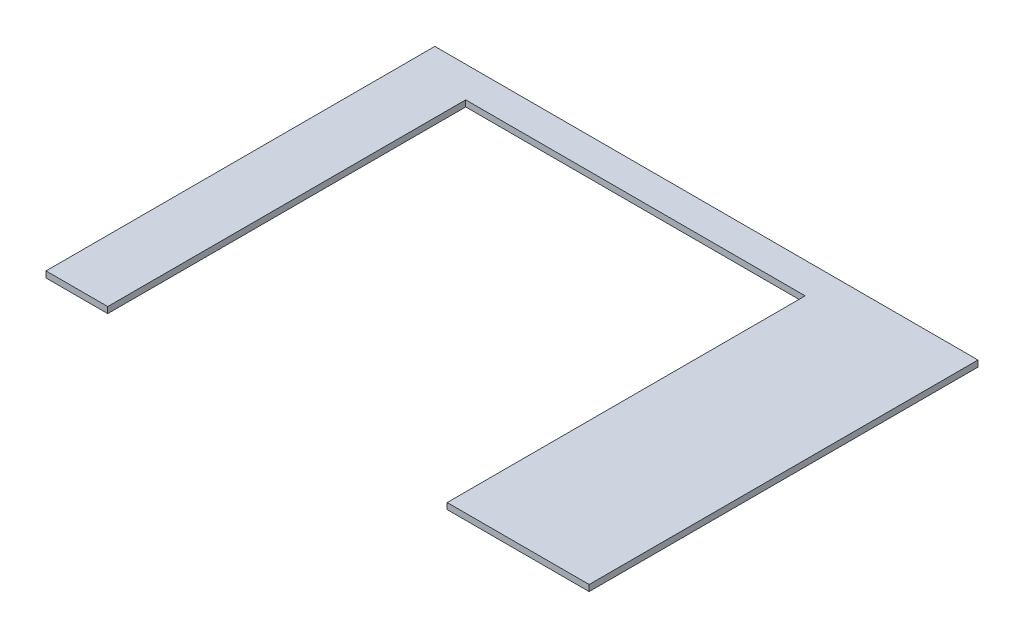
ISO-10303-21;
HEADER;
FILE_DESCRIPTION(('STEP AP214'),'2;1');
FILE_NAME('part.step','',(''),(''),'','','');
FILE_SCHEMA(('AUTOMOTIVE_DESIGN { 1 0 10303 214 1 1 1 1 }'));
ENDSEC;
DATA;
#1=APPLICATION_CONTEXT('core data for automotive mechanical design processes');
#2=APPLICATION_PROTOCOL_DEFINITION('international standard','automotive_design',2000,#1);
#3=PRODUCT_CONTEXT('',#1,'mechanical');
#4=PRODUCT('Part','Part','',(#3));
#5=PRODUCT_RELATED_PRODUCT_CATEGORY('part','',(#4));
#6=PRODUCT_DEFINITION_FORMATION('','',#4);
#7=PRODUCT_DEFINITION_CONTEXT('part definition',#1,'design');
#8=PRODUCT_DEFINITION('design','',#6,#7);
#9=PRODUCT_DEFINITION_SHAPE('','',#8);
#10=(LENGTH_UNIT() NAMED_UNIT(*) SI_UNIT(.MILLI.,.METRE.));
#11=(NAMED_UNIT(*) PLANE_ANGLE_UNIT() SI_UNIT($,.RADIAN.));
#12=(NAMED_UNIT(*) SI_UNIT($,.STERADIAN.) SOLID_ANGLE_UNIT());
#13=UNCERTAINTY_MEASURE_WITH_UNIT(LENGTH_MEASURE(1.E-05),#10,'distance_accuracy_value','');
#14=(GEOMETRIC_REPRESENTATION_CONTEXT(3) GLOBAL_UNCERTAINTY_ASSIGNED_CONTEXT((#13)) GLOBAL_UNIT_ASSIGNED_CONTEXT((#10,
#11,#12)) REPRESENTATION_CONTEXT('',''));
#15=CARTESIAN_POINT('',(0.,0.,0.));
#16=DIRECTION('',(0.,0.,1.));
#17=DIRECTION('',(1.,0.,0.));
#18=AXIS2_PLACEMENT_3D('',#15,#16,#17);
#19=CARTESIAN_POINT('',(0.,10.,0.));
#20=DIRECTION('',(1.,0.,0.));
#21=DIRECTION('',(0.,0.,-1.));
#22=AXIS2_PLACEMENT_3D('',#19,#20,#21);
#23=PLANE('',#22);
#24=DIRECTION('',(0.,0.,1.));
#25=VECTOR('',#24,1.);
#26=CARTESIAN_POINT('',(0.,0.,0.));
#27=LINE('',#26,#25);
#28=CARTESIAN_POINT('',(0.,0.,-630.));
#29=VERTEX_POINT('',#28);
#30=CARTESIAN_POINT('',(0.,0.,0.));
#31=VERTEX_POINT('',#30);
#32=EDGE_CURVE('E131',#29,#31,#27,.T.);
#33=ORIENTED_EDGE('',*,*,#32,.T.);
#34=DIRECTION('',(0.,-1.,0.));
#35=VECTOR('',#34,1.);
#36=CARTESIAN_POINT('',(0.,10.,0.));
#37=LINE('',#36,#35);
#38=CARTESIAN_POINT('',(0.,10.,0.));
#39=VERTEX_POINT('',#38);
#40=EDGE_CURVE('E11',#39,#31,#37,.T.);
#41=ORIENTED_EDGE('',*,*,#40,.F.);
#42=DIRECTION('',(0.,0.,1.));
#43=VECTOR('',#42,1.);
#44=CARTESIAN_POINT('',(0.,10.,0.));
#45=LINE('',#44,#43);
#46=CARTESIAN_POINT('',(0.,10.,-630.));
#47=VERTEX_POINT('',#46);
#48=EDGE_CURVE('E145',#47,#39,#45,.T.);
#49=ORIENTED_EDGE('',*,*,#48,.F.);
#50=DIRECTION('',(0.,-1.,0.));
#51=VECTOR('',#50,1.);
#52=CARTESIAN_POINT('',(0.,10.,-630.));
#53=LINE('',#52,#51);
#54=EDGE_CURVE('E127',#47,#29,#53,.T.);
#55=ORIENTED_EDGE('',*,*,#54,.T.);
#56=EDGE_LOOP('',(#33,#41,#49,#55));
#57=FACE_BOUND('',#56,.T.);
#58=ADVANCED_FACE('F35',(#57),#23,.F.);
#59=CARTESIAN_POINT('',(100.,10.,0.));
#60=DIRECTION('',(0.,0.,-1.));
#61=DIRECTION('',(-1.,0.,0.));
#62=AXIS2_PLACEMENT_3D('',#59,#60,#61);
#63=PLANE('',#62);
#64=DIRECTION('',(1.,0.,0.));
#65=VECTOR('',#64,1.);
#66=CARTESIAN_POINT('',(100.,0.,0.));
#67=LINE('',#66,#65);
#68=CARTESIAN_POINT('',(100.,0.,0.));
#69=VERTEX_POINT('',#68);
#70=EDGE_CURVE('E134',#31,#69,#67,.T.);
#71=ORIENTED_EDGE('',*,*,#70,.T.);
#72=DIRECTION('',(0.,-1.,0.));
#73=VECTOR('',#72,1.);
#74=CARTESIAN_POINT('',(100.,10.,0.));
#75=LINE('',#74,#73);
#76=CARTESIAN_POINT('',(100.,10.,0.));
#77=VERTEX_POINT('',#76);
#78=EDGE_CURVE('E43',#77,#69,#75,.T.);
#79=ORIENTED_EDGE('',*,*,#78,.F.);
#80=DIRECTION('',(1.,0.,0.));
#81=VECTOR('',#80,1.);
#82=CARTESIAN_POINT('',(100.,10.,0.));
#83=LINE('',#82,#81);
#84=EDGE_CURVE('E94',#39,#77,#83,.T.);
#85=ORIENTED_EDGE('',*,*,#84,.F.);
#86=ORIENTED_EDGE('',*,*,#40,.T.);
#87=EDGE_LOOP('',(#71,#79,#85,#86));
#88=FACE_BOUND('',#87,.T.);
#89=ADVANCED_FACE('F180',(#88),#63,.F.);
#90=CARTESIAN_POINT('',(100.,10.,0.));
#91=DIRECTION('',(-1.,0.,0.));
#92=DIRECTION('',(0.,0.,1.));
#93=AXIS2_PLACEMENT_3D('',#90,#91,#92);
#94=PLANE('',#93);
#95=DIRECTION('',(0.,0.,-1.));
#96=VECTOR('',#95,1.);
#97=CARTESIAN_POINT('',(100.,0.,0.));
#98=LINE('',#97,#96);
#99=CARTESIAN_POINT('',(100.,0.,-580.));
#100=VERTEX_POINT('',#99);
#101=EDGE_CURVE('E136',#69,#100,#98,.T.);
#102=ORIENTED_EDGE('',*,*,#101,.T.);
#103=DIRECTION('',(0.,-1.,0.));
#104=VECTOR('',#103,1.);
#105=CARTESIAN_POINT('',(100.,10.,-580.));
#106=LINE('',#105,#104);
#107=CARTESIAN_POINT('',(100.,10.,-580.));
#108=VERTEX_POINT('',#107);
#109=EDGE_CURVE('E152',#108,#100,#106,.T.);
#110=ORIENTED_EDGE('',*,*,#109,.F.);
#111=DIRECTION('',(0.,0.,-1.));
#112=VECTOR('',#111,1.);
#113=CARTESIAN_POINT('',(100.,10.,0.));
#114=LINE('',#113,#112);
#115=EDGE_CURVE('E160',#77,#108,#114,.T.);
#116=ORIENTED_EDGE('',*,*,#115,.F.);
#117=ORIENTED_EDGE('',*,*,#78,.T.);
#118=EDGE_LOOP('',(#102,#110,#116,#117));
#119=FACE_BOUND('',#118,.T.);
#120=ADVANCED_FACE('F158',(#119),#94,.F.);
#121=CARTESIAN_POINT('',(100.,10.,-580.));
#122=DIRECTION('',(0.,0.,-1.));
#123=DIRECTION('',(-1.,0.,0.));
#124=AXIS2_PLACEMENT_3D('',#121,#122,#123);
#125=PLANE('',#124);
#126=DIRECTION('',(1.,0.,0.));
#127=VECTOR('',#126,1.);
#128=CARTESIAN_POINT('',(100.,0.,-580.));
#129=LINE('',#128,#127);
#130=CARTESIAN_POINT('',(650.,0.,-580.));
#131=VERTEX_POINT('',#130);
#132=EDGE_CURVE('E138',#100,#131,#129,.T.);
#133=ORIENTED_EDGE('',*,*,#132,.T.);
#134=DIRECTION('',(0.,-1.,0.));
#135=VECTOR('',#134,1.);
#136=CARTESIAN_POINT('',(650.,10.,-580.));
#137=LINE('',#136,#135);
#138=CARTESIAN_POINT('',(650.,10.,-580.));
#139=VERTEX_POINT('',#138);
#140=EDGE_CURVE('E149',#139,#131,#137,.T.);
#141=ORIENTED_EDGE('',*,*,#140,.F.);
#142=DIRECTION('',(1.,0.,0.));
#143=VECTOR('',#142,1.);
#144=CARTESIAN_POINT('',(100.,10.,-580.));
#145=LINE('',#144,#143);
#146=EDGE_CURVE('E172',#108,#139,#145,.T.);
#147=ORIENTED_EDGE('',*,*,#146,.F.);
#148=ORIENTED_EDGE('',*,*,#109,.T.);
#149=EDGE_LOOP('',(#133,#141,#147,#148));
#150=FACE_BOUND('',#149,.T.);
#151=ADVANCED_FACE('F168',(#150),#125,.F.);
#152=CARTESIAN_POINT('',(650.,10.,-580.));
#153=DIRECTION('',(1.,0.,0.));
#154=DIRECTION('',(0.,0.,-1.));
#155=AXIS2_PLACEMENT_3D('',#152,#153,#154);
#156=PLANE('',#155);
#157=DIRECTION('',(0.,0.,1.));
#158=VECTOR('',#157,1.);
#159=CARTESIAN_POINT('',(650.,0.,-580.));
#160=LINE('',#159,#158);
#161=CARTESIAN_POINT('',(650.,0.,0.));
#162=VERTEX_POINT('',#161);
#163=EDGE_CURVE('E140',#131,#162,#160,.T.);
#164=ORIENTED_EDGE('',*,*,#163,.T.);
#165=DIRECTION('',(0.,-1.,0.));
#166=VECTOR('',#165,1.);
#167=CARTESIAN_POINT('',(650.,10.,0.));
#168=LINE('',#167,#166);
#169=CARTESIAN_POINT('',(650.,10.,0.));
#170=VERTEX_POINT('',#169);
#171=EDGE_CURVE('E122',#170,#162,#168,.T.);
#172=ORIENTED_EDGE('',*,*,#171,.F.);
#173=DIRECTION('',(0.,0.,1.));
#174=VECTOR('',#173,1.);
#175=CARTESIAN_POINT('',(650.,10.,-580.));
#176=LINE('',#175,#174);
#177=EDGE_CURVE('E113',#139,#170,#176,.T.);
#178=ORIENTED_EDGE('',*,*,#177,.F.);
#179=ORIENTED_EDGE('',*,*,#140,.T.);
#180=EDGE_LOOP('',(#164,#172,#178,#179));
#181=FACE_BOUND('',#180,.T.);
#182=ADVANCED_FACE('F171',(#181),#156,.F.);
#183=CARTESIAN_POINT('',(650.,10.,0.));
#184=DIRECTION('',(0.,0.,-1.));
#185=DIRECTION('',(-1.,0.,0.));
#186=AXIS2_PLACEMENT_3D('',#183,#184,#185);
#187=PLANE('',#186);
#188=DIRECTION('',(1.,0.,0.));
#189=VECTOR('',#188,1.);
#190=CARTESIAN_POINT('',(650.,0.,0.));
#191=LINE('',#190,#189);
#192=CARTESIAN_POINT('',(880.,0.,0.));
#193=VERTEX_POINT('',#192);
#194=EDGE_CURVE('E121',#162,#193,#191,.T.);
#195=ORIENTED_EDGE('',*,*,#194,.T.);
#196=DIRECTION('',(0.,-1.,0.));
#197=VECTOR('',#196,1.);
#198=CARTESIAN_POINT('',(880.,10.,0.));
#199=LINE('',#198,#197);
#200=CARTESIAN_POINT('',(880.,10.,0.));
#201=VERTEX_POINT('',#200);
#202=EDGE_CURVE('E118',#201,#193,#199,.T.);
#203=ORIENTED_EDGE('',*,*,#202,.F.);
#204=DIRECTION('',(1.,0.,0.));
#205=VECTOR('',#204,1.);
#206=CARTESIAN_POINT('',(650.,10.,0.));
#207=LINE('',#206,#205);
#208=EDGE_CURVE('E107',#170,#201,#207,.T.);
#209=ORIENTED_EDGE('',*,*,#208,.F.);
#210=ORIENTED_EDGE('',*,*,#171,.T.);
#211=EDGE_LOOP('',(#195,#203,#209,#210));
#212=FACE_BOUND('',#211,.T.);
#213=ADVANCED_FACE('F119',(#212),#187,.F.);
#214=CARTESIAN_POINT('',(880.,10.,0.));
#215=DIRECTION('',(-1.,0.,0.));
#216=DIRECTION('',(0.,0.,1.));
#217=AXIS2_PLACEMENT_3D('',#214,#215,#216);
#218=PLANE('',#217);
#219=DIRECTION('',(0.,0.,-1.));
#220=VECTOR('',#219,1.);
#221=CARTESIAN_POINT('',(880.,0.,0.));
#222=LINE('',#221,#220);
#223=CARTESIAN_POINT('',(880.,0.,-630.));
#224=VERTEX_POINT('',#223);
#225=EDGE_CURVE('E80',#193,#224,#222,.T.);
#226=ORIENTED_EDGE('',*,*,#225,.T.);
#227=DIRECTION('',(0.,-1.,0.));
#228=VECTOR('',#227,1.);
#229=CARTESIAN_POINT('',(880.,10.,-630.));
#230=LINE('',#229,#228);
#231=CARTESIAN_POINT('',(880.,10.,-630.));
#232=VERTEX_POINT('',#231);
#233=EDGE_CURVE('E123',#232,#224,#230,.T.);
#234=ORIENTED_EDGE('',*,*,#233,.F.);
#235=DIRECTION('',(0.,0.,-1.));
#236=VECTOR('',#235,1.);
#237=CARTESIAN_POINT('',(880.,10.,0.));
#238=LINE('',#237,#236);
#239=EDGE_CURVE('E111',#201,#232,#238,.T.);
#240=ORIENTED_EDGE('',*,*,#239,.F.);
#241=ORIENTED_EDGE('',*,*,#202,.T.);
#242=EDGE_LOOP('',(#226,#234,#240,#241));
#243=FACE_BOUND('',#242,.T.);
#244=ADVANCED_FACE('F125',(#243),#218,.F.);
#245=CARTESIAN_POINT('',(0.,10.,-630.));
#246=DIRECTION('',(0.,0.,1.));
#247=DIRECTION('',(1.,0.,0.));
#248=AXIS2_PLACEMENT_3D('',#245,#246,#247);
#249=PLANE('',#248);
#250=DIRECTION('',(-1.,0.,0.));
#251=VECTOR('',#250,1.);
#252=CARTESIAN_POINT('',(0.,0.,-630.));
#253=LINE('',#252,#251);
#254=EDGE_CURVE('E86',#224,#29,#253,.T.);
#255=ORIENTED_EDGE('',*,*,#254,.T.);
#256=ORIENTED_EDGE('',*,*,#54,.F.);
#257=DIRECTION('',(-1.,0.,0.));
#258=VECTOR('',#257,1.);
#259=CARTESIAN_POINT('',(0.,10.,-630.));
#260=LINE('',#259,#258);
#261=EDGE_CURVE('E51',#232,#47,#260,.T.);
#262=ORIENTED_EDGE('',*,*,#261,.F.);
#263=ORIENTED_EDGE('',*,*,#233,.T.);
#264=EDGE_LOOP('',(#255,#256,#262,#263));
#265=FACE_BOUND('',#264,.T.);
#266=ADVANCED_FACE('F196',(#265),#249,.F.);
#267=CARTESIAN_POINT('',(0.,10.,0.));
#268=DIRECTION('',(0.,-1.,0.));
#269=DIRECTION('',(0.,0.,-1.));
#270=AXIS2_PLACEMENT_3D('',#267,#268,#269);
#271=PLANE('',#270);
#272=ORIENTED_EDGE('',*,*,#48,.T.);
#273=ORIENTED_EDGE('',*,*,#84,.T.);
#274=ORIENTED_EDGE('',*,*,#115,.T.);
#275=ORIENTED_EDGE('',*,*,#146,.T.);
#276=ORIENTED_EDGE('',*,*,#177,.T.);
#277=ORIENTED_EDGE('',*,*,#208,.T.);
#278=ORIENTED_EDGE('',*,*,#239,.T.);
#279=ORIENTED_EDGE('',*,*,#261,.T.);
#280=EDGE_LOOP('',(#272,#273,#274,#275,#276,#277,#278,#279));
#281=FACE_BOUND('',#280,.T.);
#282=ADVANCED_FACE('F109',(#281),#271,.F.);
#283=CARTESIAN_POINT('',(0.,0.,0.));
#284=DIRECTION('',(0.,-1.,0.));
#285=DIRECTION('',(0.,0.,-1.));
#286=AXIS2_PLACEMENT_3D('',#283,#284,#285);
#287=PLANE('',#286);
#288=ORIENTED_EDGE('',*,*,#32,.F.);
#289=ORIENTED_EDGE('',*,*,#254,.F.);
#290=ORIENTED_EDGE('',*,*,#225,.F.);
#291=ORIENTED_EDGE('',*,*,#194,.F.);
#292=ORIENTED_EDGE('',*,*,#163,.F.);
#293=ORIENTED_EDGE('',*,*,#132,.F.);
#294=ORIENTED_EDGE('',*,*,#101,.F.);
#295=ORIENTED_EDGE('',*,*,#70,.F.);
#296=EDGE_LOOP('',(#288,#289,#290,#291,#292,#293,#294,#295));
#297=FACE_BOUND('',#296,.T.);
#298=ADVANCED_FACE('F164',(#297),#287,.T.);
#299=CLOSED_SHELL('',(#58,#89,#120,#151,#182,#213,#244,#266,#282,#298));
#300=MANIFOLD_SOLID_BREP('B2',#299);
#301=ADVANCED_BREP_SHAPE_REPRESENTATION('',(#18,#300),#14);
#302=SHAPE_DEFINITION_REPRESENTATION(#9,#301);
ENDSEC;
END-ISO-10303-21;
